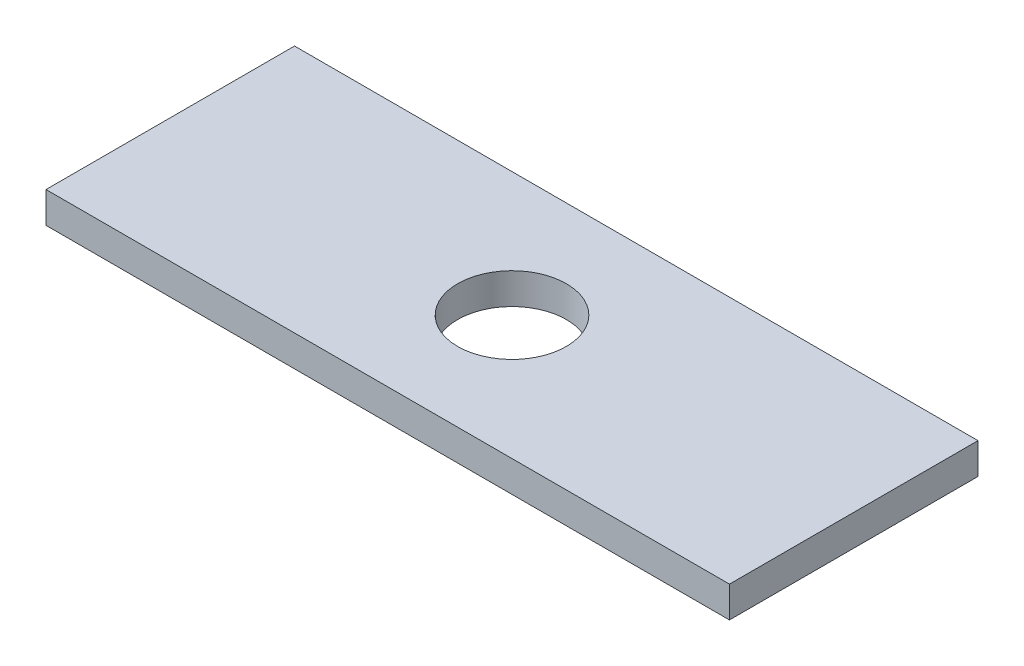
ISO-10303-21;
HEADER;
FILE_DESCRIPTION(('STEP AP214'),'2;1');
FILE_NAME('part.step','',(''),(''),'','','');
FILE_SCHEMA(('AUTOMOTIVE_DESIGN { 1 0 10303 214 1 1 1 1 }'));
ENDSEC;
DATA;
#1=APPLICATION_CONTEXT('core data for automotive mechanical design processes');
#2=APPLICATION_PROTOCOL_DEFINITION('international standard','automotive_design',2000,#1);
#3=PRODUCT_CONTEXT('',#1,'mechanical');
#4=PRODUCT('Part','Part','',(#3));
#5=PRODUCT_RELATED_PRODUCT_CATEGORY('part','',(#4));
#6=PRODUCT_DEFINITION_FORMATION('','',#4);
#7=PRODUCT_DEFINITION_CONTEXT('part definition',#1,'design');
#8=PRODUCT_DEFINITION('design','',#6,#7);
#9=PRODUCT_DEFINITION_SHAPE('','',#8);
#10=(LENGTH_UNIT() NAMED_UNIT(*) SI_UNIT(.MILLI.,.METRE.));
#11=(NAMED_UNIT(*) PLANE_ANGLE_UNIT() SI_UNIT($,.RADIAN.));
#12=(NAMED_UNIT(*) SI_UNIT($,.STERADIAN.) SOLID_ANGLE_UNIT());
#13=UNCERTAINTY_MEASURE_WITH_UNIT(LENGTH_MEASURE(1.E-05),#10,'distance_accuracy_value','');
#14=(GEOMETRIC_REPRESENTATION_CONTEXT(3) GLOBAL_UNCERTAINTY_ASSIGNED_CONTEXT((#13)) GLOBAL_UNIT_ASSIGNED_CONTEXT((#10,
#11,#12)) REPRESENTATION_CONTEXT('',''));
#15=CARTESIAN_POINT('',(0.,0.,0.));
#16=DIRECTION('',(0.,0.,1.));
#17=DIRECTION('',(1.,0.,0.));
#18=AXIS2_PLACEMENT_3D('',#15,#16,#17);
#19=CARTESIAN_POINT('',(0.,6.35,0.));
#20=DIRECTION('',(1.,0.,0.));
#21=DIRECTION('',(0.,0.,-1.));
#22=AXIS2_PLACEMENT_3D('',#19,#20,#21);
#23=PLANE('',#22);
#24=DIRECTION('',(0.,0.,1.));
#25=VECTOR('',#24,1.);
#26=CARTESIAN_POINT('',(0.,0.,0.));
#27=LINE('',#26,#25);
#28=CARTESIAN_POINT('',(0.,0.,0.));
#29=VERTEX_POINT('',#28);
#30=CARTESIAN_POINT('',(0.,0.,50.8));
#31=VERTEX_POINT('',#30);
#32=EDGE_CURVE('E98',#29,#31,#27,.T.);
#33=ORIENTED_EDGE('',*,*,#32,.T.);
#34=DIRECTION('',(0.,-1.,0.));
#35=VECTOR('',#34,1.);
#36=CARTESIAN_POINT('',(0.,6.35,50.8));
#37=LINE('',#36,#35);
#38=CARTESIAN_POINT('',(0.,6.35,50.8));
#39=VERTEX_POINT('',#38);
#40=EDGE_CURVE('E11',#39,#31,#37,.T.);
#41=ORIENTED_EDGE('',*,*,#40,.F.);
#42=DIRECTION('',(0.,0.,1.));
#43=VECTOR('',#42,1.);
#44=CARTESIAN_POINT('',(0.,6.35,0.));
#45=LINE('',#44,#43);
#46=CARTESIAN_POINT('',(0.,6.35,0.));
#47=VERTEX_POINT('',#46);
#48=EDGE_CURVE('E86',#47,#39,#45,.T.);
#49=ORIENTED_EDGE('',*,*,#48,.F.);
#50=DIRECTION('',(0.,-1.,0.));
#51=VECTOR('',#50,1.);
#52=CARTESIAN_POINT('',(0.,6.35,0.));
#53=LINE('',#52,#51);
#54=EDGE_CURVE('E94',#47,#29,#53,.T.);
#55=ORIENTED_EDGE('',*,*,#54,.T.);
#56=EDGE_LOOP('',(#33,#41,#49,#55));
#57=FACE_BOUND('',#56,.T.);
#58=ADVANCED_FACE('F35',(#57),#23,.F.);
#59=CARTESIAN_POINT('',(0.,6.35,50.8));
#60=DIRECTION('',(0.,0.,-1.));
#61=DIRECTION('',(-1.,0.,0.));
#62=AXIS2_PLACEMENT_3D('',#59,#60,#61);
#63=PLANE('',#62);
#64=DIRECTION('',(1.,0.,0.));
#65=VECTOR('',#64,1.);
#66=CARTESIAN_POINT('',(0.,0.,50.8));
#67=LINE('',#66,#65);
#68=CARTESIAN_POINT('',(139.7,0.,50.8));
#69=VERTEX_POINT('',#68);
#70=EDGE_CURVE('E90',#31,#69,#67,.T.);
#71=ORIENTED_EDGE('',*,*,#70,.T.);
#72=DIRECTION('',(0.,-1.,0.));
#73=VECTOR('',#72,1.);
#74=CARTESIAN_POINT('',(139.7,6.35,50.8));
#75=LINE('',#74,#73);
#76=CARTESIAN_POINT('',(139.7,6.35,50.8));
#77=VERTEX_POINT('',#76);
#78=EDGE_CURVE('E43',#77,#69,#75,.T.);
#79=ORIENTED_EDGE('',*,*,#78,.F.);
#80=DIRECTION('',(1.,0.,0.));
#81=VECTOR('',#80,1.);
#82=CARTESIAN_POINT('',(0.,6.35,50.8));
#83=LINE('',#82,#81);
#84=EDGE_CURVE('E81',#39,#77,#83,.T.);
#85=ORIENTED_EDGE('',*,*,#84,.F.);
#86=ORIENTED_EDGE('',*,*,#40,.T.);
#87=EDGE_LOOP('',(#71,#79,#85,#86));
#88=FACE_BOUND('',#87,.T.);
#89=ADVANCED_FACE('F89',(#88),#63,.F.);
#90=CARTESIAN_POINT('',(139.7,6.35,0.));
#91=DIRECTION('',(-1.,0.,0.));
#92=DIRECTION('',(0.,0.,1.));
#93=AXIS2_PLACEMENT_3D('',#90,#91,#92);
#94=PLANE('',#93);
#95=DIRECTION('',(0.,0.,-1.));
#96=VECTOR('',#95,1.);
#97=CARTESIAN_POINT('',(139.7,0.,0.));
#98=LINE('',#97,#96);
#99=CARTESIAN_POINT('',(139.7,0.,0.));
#100=VERTEX_POINT('',#99);
#101=EDGE_CURVE('E68',#69,#100,#98,.T.);
#102=ORIENTED_EDGE('',*,*,#101,.T.);
#103=DIRECTION('',(0.,-1.,0.));
#104=VECTOR('',#103,1.);
#105=CARTESIAN_POINT('',(139.7,6.35,0.));
#106=LINE('',#105,#104);
#107=CARTESIAN_POINT('',(139.7,6.35,0.));
#108=VERTEX_POINT('',#107);
#109=EDGE_CURVE('E91',#108,#100,#106,.T.);
#110=ORIENTED_EDGE('',*,*,#109,.F.);
#111=DIRECTION('',(0.,0.,-1.));
#112=VECTOR('',#111,1.);
#113=CARTESIAN_POINT('',(139.7,6.35,0.));
#114=LINE('',#113,#112);
#115=EDGE_CURVE('E84',#77,#108,#114,.T.);
#116=ORIENTED_EDGE('',*,*,#115,.F.);
#117=ORIENTED_EDGE('',*,*,#78,.T.);
#118=EDGE_LOOP('',(#102,#110,#116,#117));
#119=FACE_BOUND('',#118,.T.);
#120=ADVANCED_FACE('F92',(#119),#94,.F.);
#121=CARTESIAN_POINT('',(0.,6.35,0.));
#122=DIRECTION('',(0.,0.,1.));
#123=DIRECTION('',(1.,0.,0.));
#124=AXIS2_PLACEMENT_3D('',#121,#122,#123);
#125=PLANE('',#124);
#126=DIRECTION('',(-1.,0.,0.));
#127=VECTOR('',#126,1.);
#128=CARTESIAN_POINT('',(0.,0.,0.));
#129=LINE('',#128,#127);
#130=EDGE_CURVE('E74',#100,#29,#129,.T.);
#131=ORIENTED_EDGE('',*,*,#130,.T.);
#132=ORIENTED_EDGE('',*,*,#54,.F.);
#133=DIRECTION('',(-1.,0.,0.));
#134=VECTOR('',#133,1.);
#135=CARTESIAN_POINT('',(0.,6.35,0.));
#136=LINE('',#135,#134);
#137=EDGE_CURVE('E51',#108,#47,#136,.T.);
#138=ORIENTED_EDGE('',*,*,#137,.F.);
#139=ORIENTED_EDGE('',*,*,#109,.T.);
#140=EDGE_LOOP('',(#131,#132,#138,#139));
#141=FACE_BOUND('',#140,.T.);
#142=ADVANCED_FACE('F106',(#141),#125,.F.);
#143=CARTESIAN_POINT('',(0.,6.35,0.));
#144=DIRECTION('',(0.,1.,0.));
#145=DIRECTION('',(0.,0.,1.));
#146=AXIS2_PLACEMENT_3D('',#143,#144,#145);
#147=PLANE('',#146);
#148=CARTESIAN_POINT('',(69.85,6.35,25.4));
#149=DIRECTION('',(0.,1.,0.));
#150=DIRECTION('',(0.,0.,1.));
#151=AXIS2_PLACEMENT_3D('',#148,#149,#150);
#152=CIRCLE('',#151,11.1125);
#153=CARTESIAN_POINT('',(69.85,6.35,36.5125));
#154=VERTEX_POINT('',#153);
#155=EDGE_CURVE('E112',#154,#154,#152,.T.);
#156=ORIENTED_EDGE('',*,*,#155,.F.);
#157=EDGE_LOOP('',(#156));
#158=FACE_BOUND('',#157,.T.);
#159=ORIENTED_EDGE('',*,*,#48,.T.);
#160=ORIENTED_EDGE('',*,*,#84,.T.);
#161=ORIENTED_EDGE('',*,*,#115,.T.);
#162=ORIENTED_EDGE('',*,*,#137,.T.);
#163=EDGE_LOOP('',(#159,#160,#161,#162));
#164=FACE_BOUND('',#163,.T.);
#165=ADVANCED_FACE('F82',(#158,#164),#147,.T.);
#166=CARTESIAN_POINT('',(0.,0.,0.));
#167=DIRECTION('',(0.,1.,0.));
#168=DIRECTION('',(0.,0.,1.));
#169=AXIS2_PLACEMENT_3D('',#166,#167,#168);
#170=PLANE('',#169);
#171=CARTESIAN_POINT('',(69.85,0.,25.4));
#172=DIRECTION('',(0.,1.,0.));
#173=DIRECTION('',(0.,0.,1.));
#174=AXIS2_PLACEMENT_3D('',#171,#172,#173);
#175=CIRCLE('',#174,11.1125);
#176=CARTESIAN_POINT('',(69.85,0.,36.5125));
#177=VERTEX_POINT('',#176);
#178=EDGE_CURVE('E101',#177,#177,#175,.T.);
#179=ORIENTED_EDGE('',*,*,#178,.T.);
#180=EDGE_LOOP('',(#179));
#181=FACE_BOUND('',#180,.T.);
#182=ORIENTED_EDGE('',*,*,#32,.F.);
#183=ORIENTED_EDGE('',*,*,#130,.F.);
#184=ORIENTED_EDGE('',*,*,#101,.F.);
#185=ORIENTED_EDGE('',*,*,#70,.F.);
#186=EDGE_LOOP('',(#182,#183,#184,#185));
#187=FACE_BOUND('',#186,.T.);
#188=ADVANCED_FACE('F109',(#181,#187),#170,.F.);
#189=CARTESIAN_POINT('',(69.85,0.,25.4));
#190=DIRECTION('',(0.,1.,0.));
#191=DIRECTION('',(0.,0.,1.));
#192=AXIS2_PLACEMENT_3D('',#189,#190,#191);
#193=CYLINDRICAL_SURFACE('',#192,11.1125);
#194=ORIENTED_EDGE('',*,*,#178,.F.);
#195=EDGE_LOOP('',(#194));
#196=FACE_BOUND('',#195,.T.);
#197=ORIENTED_EDGE('',*,*,#155,.T.);
#198=EDGE_LOOP('',(#197));
#199=FACE_BOUND('',#198,.T.);
#200=ADVANCED_FACE('F119',(#196,#199),#193,.F.);
#201=CLOSED_SHELL('',(#58,#89,#120,#142,#165,#188,#200));
#202=MANIFOLD_SOLID_BREP('B2',#201);
#203=ADVANCED_BREP_SHAPE_REPRESENTATION('',(#18,#202),#14);
#204=SHAPE_DEFINITION_REPRESENTATION(#9,#203);
ENDSEC;
END-ISO-10303-21;
